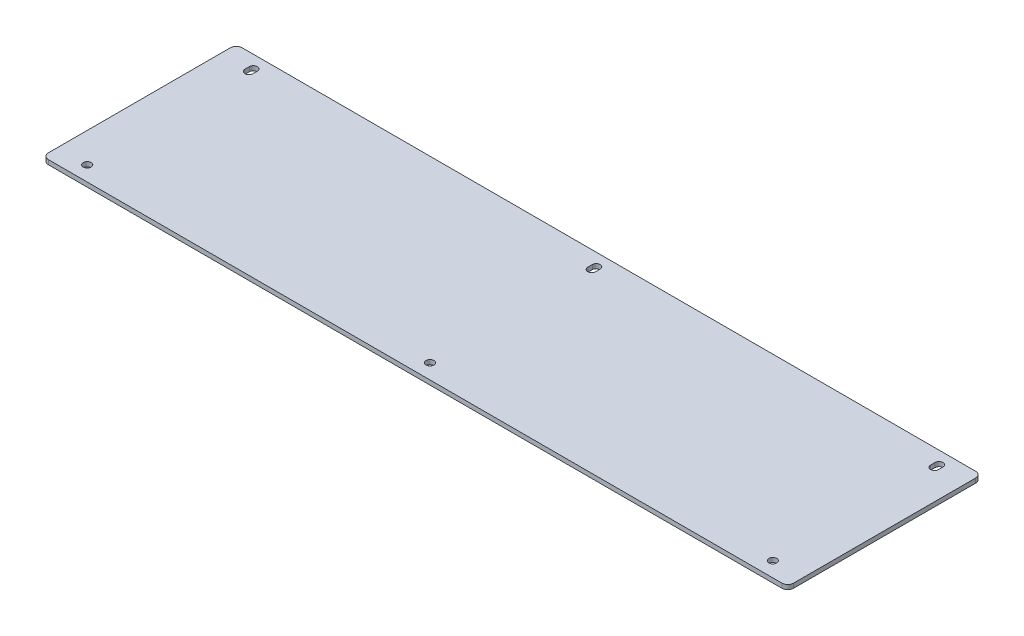
ISO-10303-21;
HEADER;
FILE_DESCRIPTION(('STEP AP214'),'2;1');
FILE_NAME('part.step','',(''),(''),'','','');
FILE_SCHEMA(('AUTOMOTIVE_DESIGN { 1 0 10303 214 1 1 1 1 }'));
ENDSEC;
DATA;
#1=APPLICATION_CONTEXT('core data for automotive mechanical design processes');
#2=APPLICATION_PROTOCOL_DEFINITION('international standard','automotive_design',2000,#1);
#3=PRODUCT_CONTEXT('',#1,'mechanical');
#4=PRODUCT('Part','Part','',(#3));
#5=PRODUCT_RELATED_PRODUCT_CATEGORY('part','',(#4));
#6=PRODUCT_DEFINITION_FORMATION('','',#4);
#7=PRODUCT_DEFINITION_CONTEXT('part definition',#1,'design');
#8=PRODUCT_DEFINITION('design','',#6,#7);
#9=PRODUCT_DEFINITION_SHAPE('','',#8);
#10=(LENGTH_UNIT() NAMED_UNIT(*) SI_UNIT(.MILLI.,.METRE.));
#11=(NAMED_UNIT(*) PLANE_ANGLE_UNIT() SI_UNIT($,.RADIAN.));
#12=(NAMED_UNIT(*) SI_UNIT($,.STERADIAN.) SOLID_ANGLE_UNIT());
#13=UNCERTAINTY_MEASURE_WITH_UNIT(LENGTH_MEASURE(1.E-05),#10,'distance_accuracy_value','');
#14=(GEOMETRIC_REPRESENTATION_CONTEXT(3) GLOBAL_UNCERTAINTY_ASSIGNED_CONTEXT((#13)) GLOBAL_UNIT_ASSIGNED_CONTEXT((#10,
#11,#12)) REPRESENTATION_CONTEXT('',''));
#15=CARTESIAN_POINT('',(0.,0.,0.));
#16=DIRECTION('',(0.,0.,1.));
#17=DIRECTION('',(1.,0.,0.));
#18=AXIS2_PLACEMENT_3D('',#15,#16,#17);
#19=CARTESIAN_POINT('',(250.,3.,65.));
#20=DIRECTION('',(-1.,0.,0.));
#21=DIRECTION('',(0.,0.,1.));
#22=AXIS2_PLACEMENT_3D('',#19,#20,#21);
#23=PLANE('',#22);
#24=DIRECTION('',(0.,0.,-1.));
#25=VECTOR('',#24,1.);
#26=CARTESIAN_POINT('',(250.,0.,65.));
#27=LINE('',#26,#25);
#28=CARTESIAN_POINT('',(250.,0.,61.));
#29=VERTEX_POINT('',#28);
#30=CARTESIAN_POINT('',(250.,0.,-61.));
#31=VERTEX_POINT('',#30);
#32=EDGE_CURVE('E294',#29,#31,#27,.T.);
#33=ORIENTED_EDGE('',*,*,#32,.T.);
#34=DIRECTION('',(0.,-1.,0.));
#35=VECTOR('',#34,1.);
#36=CARTESIAN_POINT('',(250.,3.,-61.));
#37=LINE('',#36,#35);
#38=CARTESIAN_POINT('',(250.,3.,-61.));
#39=VERTEX_POINT('',#38);
#40=EDGE_CURVE('E11',#31,#39,#37,.F.);
#41=ORIENTED_EDGE('',*,*,#40,.T.);
#42=DIRECTION('',(0.,0.,-1.));
#43=VECTOR('',#42,1.);
#44=CARTESIAN_POINT('',(250.,3.,65.));
#45=LINE('',#44,#43);
#46=CARTESIAN_POINT('',(250.,3.,61.));
#47=VERTEX_POINT('',#46);
#48=EDGE_CURVE('E295',#47,#39,#45,.T.);
#49=ORIENTED_EDGE('',*,*,#48,.F.);
#50=DIRECTION('',(0.,-1.,0.));
#51=VECTOR('',#50,1.);
#52=CARTESIAN_POINT('',(250.,3.,61.));
#53=LINE('',#52,#51);
#54=EDGE_CURVE('E43',#47,#29,#53,.T.);
#55=ORIENTED_EDGE('',*,*,#54,.T.);
#56=EDGE_LOOP('',(#33,#41,#49,#55));
#57=FACE_BOUND('',#56,.T.);
#58=ADVANCED_FACE('F35',(#57),#23,.F.);
#59=CARTESIAN_POINT('',(-250.,3.,-65.));
#60=DIRECTION('',(0.,0.,1.));
#61=DIRECTION('',(1.,0.,0.));
#62=AXIS2_PLACEMENT_3D('',#59,#60,#61);
#63=PLANE('',#62);
#64=DIRECTION('',(-1.,0.,0.));
#65=VECTOR('',#64,1.);
#66=CARTESIAN_POINT('',(-250.,0.,-65.));
#67=LINE('',#66,#65);
#68=CARTESIAN_POINT('',(246.,0.,-65.));
#69=VERTEX_POINT('',#68);
#70=CARTESIAN_POINT('',(-246.,0.,-65.));
#71=VERTEX_POINT('',#70);
#72=EDGE_CURVE('E311',#69,#71,#67,.T.);
#73=ORIENTED_EDGE('',*,*,#72,.T.);
#74=DIRECTION('',(0.,-1.,0.));
#75=VECTOR('',#74,1.);
#76=CARTESIAN_POINT('',(-246.,3.,-65.));
#77=LINE('',#76,#75);
#78=CARTESIAN_POINT('',(-246.,3.,-65.));
#79=VERTEX_POINT('',#78);
#80=EDGE_CURVE('E347',#71,#79,#77,.F.);
#81=ORIENTED_EDGE('',*,*,#80,.T.);
#82=DIRECTION('',(-1.,0.,0.));
#83=VECTOR('',#82,1.);
#84=CARTESIAN_POINT('',(-250.,3.,-65.));
#85=LINE('',#84,#83);
#86=CARTESIAN_POINT('',(246.,3.,-65.));
#87=VERTEX_POINT('',#86);
#88=EDGE_CURVE('E298',#87,#79,#85,.T.);
#89=ORIENTED_EDGE('',*,*,#88,.F.);
#90=DIRECTION('',(0.,-1.,0.));
#91=VECTOR('',#90,1.);
#92=CARTESIAN_POINT('',(246.,3.,-65.));
#93=LINE('',#92,#91);
#94=EDGE_CURVE('E344',#87,#69,#93,.T.);
#95=ORIENTED_EDGE('',*,*,#94,.T.);
#96=EDGE_LOOP('',(#73,#81,#89,#95));
#97=FACE_BOUND('',#96,.T.);
#98=ADVANCED_FACE('F365',(#97),#63,.F.);
#99=CARTESIAN_POINT('',(-250.,3.,65.));
#100=DIRECTION('',(1.,0.,0.));
#101=DIRECTION('',(0.,0.,-1.));
#102=AXIS2_PLACEMENT_3D('',#99,#100,#101);
#103=PLANE('',#102);
#104=DIRECTION('',(0.,0.,1.));
#105=VECTOR('',#104,1.);
#106=CARTESIAN_POINT('',(-250.,0.,65.));
#107=LINE('',#106,#105);
#108=CARTESIAN_POINT('',(-250.,0.,-61.));
#109=VERTEX_POINT('',#108);
#110=CARTESIAN_POINT('',(-250.,0.,61.));
#111=VERTEX_POINT('',#110);
#112=EDGE_CURVE('E314',#109,#111,#107,.T.);
#113=ORIENTED_EDGE('',*,*,#112,.T.);
#114=DIRECTION('',(0.,-1.,0.));
#115=VECTOR('',#114,1.);
#116=CARTESIAN_POINT('',(-250.,3.,61.));
#117=LINE('',#116,#115);
#118=CARTESIAN_POINT('',(-250.,3.,61.));
#119=VERTEX_POINT('',#118);
#120=EDGE_CURVE('E334',#111,#119,#117,.F.);
#121=ORIENTED_EDGE('',*,*,#120,.T.);
#122=DIRECTION('',(0.,0.,1.));
#123=VECTOR('',#122,1.);
#124=CARTESIAN_POINT('',(-250.,3.,65.));
#125=LINE('',#124,#123);
#126=CARTESIAN_POINT('',(-250.,3.,-61.));
#127=VERTEX_POINT('',#126);
#128=EDGE_CURVE('E302',#127,#119,#125,.T.);
#129=ORIENTED_EDGE('',*,*,#128,.F.);
#130=DIRECTION('',(0.,-1.,0.));
#131=VECTOR('',#130,1.);
#132=CARTESIAN_POINT('',(-250.,3.,-61.));
#133=LINE('',#132,#131);
#134=EDGE_CURVE('E331',#127,#109,#133,.T.);
#135=ORIENTED_EDGE('',*,*,#134,.T.);
#136=EDGE_LOOP('',(#113,#121,#129,#135));
#137=FACE_BOUND('',#136,.T.);
#138=ADVANCED_FACE('F376',(#137),#103,.F.);
#139=CARTESIAN_POINT('',(-250.,3.,65.));
#140=DIRECTION('',(0.,0.,-1.));
#141=DIRECTION('',(-1.,0.,0.));
#142=AXIS2_PLACEMENT_3D('',#139,#140,#141);
#143=PLANE('',#142);
#144=DIRECTION('',(1.,0.,0.));
#145=VECTOR('',#144,1.);
#146=CARTESIAN_POINT('',(-250.,3.,65.));
#147=LINE('',#146,#145);
#148=CARTESIAN_POINT('',(-246.,3.,65.));
#149=VERTEX_POINT('',#148);
#150=CARTESIAN_POINT('',(246.,3.,65.));
#151=VERTEX_POINT('',#150);
#152=EDGE_CURVE('E305',#149,#151,#147,.T.);
#153=ORIENTED_EDGE('',*,*,#152,.F.);
#154=DIRECTION('',(0.,-1.,0.));
#155=VECTOR('',#154,1.);
#156=CARTESIAN_POINT('',(-246.,3.,65.));
#157=LINE('',#156,#155);
#158=CARTESIAN_POINT('',(-246.,0.,65.));
#159=VERTEX_POINT('',#158);
#160=EDGE_CURVE('E320',#149,#159,#157,.T.);
#161=ORIENTED_EDGE('',*,*,#160,.T.);
#162=DIRECTION('',(1.,0.,0.));
#163=VECTOR('',#162,1.);
#164=CARTESIAN_POINT('',(-250.,0.,65.));
#165=LINE('',#164,#163);
#166=CARTESIAN_POINT('',(246.,0.,65.));
#167=VERTEX_POINT('',#166);
#168=EDGE_CURVE('E299',#159,#167,#165,.T.);
#169=ORIENTED_EDGE('',*,*,#168,.T.);
#170=DIRECTION('',(0.,-1.,0.));
#171=VECTOR('',#170,1.);
#172=CARTESIAN_POINT('',(246.,3.,65.));
#173=LINE('',#172,#171);
#174=EDGE_CURVE('E308',#167,#151,#173,.F.);
#175=ORIENTED_EDGE('',*,*,#174,.T.);
#176=EDGE_LOOP('',(#153,#161,#169,#175));
#177=FACE_BOUND('',#176,.T.);
#178=ADVANCED_FACE('F384',(#177),#143,.F.);
#179=CARTESIAN_POINT('',(0.,3.,0.));
#180=DIRECTION('',(0.,-1.,0.));
#181=DIRECTION('',(0.,0.,-1.));
#182=AXIS2_PLACEMENT_3D('',#179,#180,#181);
#183=PLANE('',#182);
#184=DIRECTION('',(0.,0.,-1.));
#185=VECTOR('',#184,1.);
#186=CARTESIAN_POINT('',(232.65,3.,-53.5000000000001));
#187=LINE('',#186,#185);
#188=CARTESIAN_POINT('',(232.65,3.,-53.5000000000001));
#189=VERTEX_POINT('',#188);
#190=CARTESIAN_POINT('',(232.65,3.,-56.5000000000001));
#191=VERTEX_POINT('',#190);
#192=EDGE_CURVE('E262',#189,#191,#187,.T.);
#193=ORIENTED_EDGE('',*,*,#192,.F.);
#194=CARTESIAN_POINT('',(230.,3.,-53.5000000000001));
#195=DIRECTION('',(0.,1.,0.));
#196=DIRECTION('',(0.,0.,1.));
#197=AXIS2_PLACEMENT_3D('',#194,#195,#196);
#198=CIRCLE('',#197,2.64999999999999);
#199=CARTESIAN_POINT('',(227.35,3.,-53.5000000000001));
#200=VERTEX_POINT('',#199);
#201=EDGE_CURVE('E259',#200,#189,#198,.T.);
#202=ORIENTED_EDGE('',*,*,#201,.F.);
#203=DIRECTION('',(0.,0.,1.));
#204=VECTOR('',#203,1.);
#205=CARTESIAN_POINT('',(227.35,3.,-53.5000000000001));
#206=LINE('',#205,#204);
#207=CARTESIAN_POINT('',(227.35,3.,-56.5000000000001));
#208=VERTEX_POINT('',#207);
#209=EDGE_CURVE('E249',#208,#200,#206,.T.);
#210=ORIENTED_EDGE('',*,*,#209,.F.);
#211=CARTESIAN_POINT('',(230.,3.,-56.5000000000001));
#212=DIRECTION('',(0.,1.,0.));
#213=DIRECTION('',(0.,0.,1.));
#214=AXIS2_PLACEMENT_3D('',#211,#212,#213);
#215=CIRCLE('',#214,2.64999999999999);
#216=EDGE_CURVE('E264',#191,#208,#215,.T.);
#217=ORIENTED_EDGE('',*,*,#216,.F.);
#218=EDGE_LOOP('',(#193,#202,#210,#217));
#219=FACE_BOUND('',#218,.T.);
#220=CARTESIAN_POINT('',(-230.,3.,55.));
#221=DIRECTION('',(0.,1.,0.));
#222=DIRECTION('',(0.,0.,1.));
#223=AXIS2_PLACEMENT_3D('',#220,#221,#222);
#224=CIRCLE('',#223,2.64999999999999);
#225=CARTESIAN_POINT('',(-230.,3.,57.65));
#226=VERTEX_POINT('',#225);
#227=EDGE_CURVE('E210',#226,#226,#224,.T.);
#228=ORIENTED_EDGE('',*,*,#227,.F.);
#229=EDGE_LOOP('',(#228));
#230=FACE_BOUND('',#229,.T.);
#231=DIRECTION('',(0.,0.,-1.));
#232=VECTOR('',#231,1.);
#233=CARTESIAN_POINT('',(-227.35,3.,-53.5));
#234=LINE('',#233,#232);
#235=CARTESIAN_POINT('',(-227.35,3.,-53.5));
#236=VERTEX_POINT('',#235);
#237=CARTESIAN_POINT('',(-227.35,3.,-56.5));
#238=VERTEX_POINT('',#237);
#239=EDGE_CURVE('E50',#236,#238,#234,.T.);
#240=ORIENTED_EDGE('',*,*,#239,.F.);
#241=CARTESIAN_POINT('',(-230.,3.,-53.5));
#242=DIRECTION('',(0.,1.,0.));
#243=DIRECTION('',(0.,0.,1.));
#244=AXIS2_PLACEMENT_3D('',#241,#242,#243);
#245=CIRCLE('',#244,2.64999999999999);
#246=CARTESIAN_POINT('',(-232.65,3.,-53.5));
#247=VERTEX_POINT('',#246);
#248=EDGE_CURVE('E191',#247,#236,#245,.T.);
#249=ORIENTED_EDGE('',*,*,#248,.F.);
#250=DIRECTION('',(0.,0.,1.));
#251=VECTOR('',#250,1.);
#252=CARTESIAN_POINT('',(-232.65,3.,-53.5));
#253=LINE('',#252,#251);
#254=CARTESIAN_POINT('',(-232.65,3.,-56.5));
#255=VERTEX_POINT('',#254);
#256=EDGE_CURVE('E196',#255,#247,#253,.T.);
#257=ORIENTED_EDGE('',*,*,#256,.F.);
#258=CARTESIAN_POINT('',(-230.,3.,-56.5));
#259=DIRECTION('',(0.,1.,0.));
#260=DIRECTION('',(0.,0.,1.));
#261=AXIS2_PLACEMENT_3D('',#258,#259,#260);
#262=CIRCLE('',#261,2.64999999999999);
#263=EDGE_CURVE('E198',#238,#255,#262,.T.);
#264=ORIENTED_EDGE('',*,*,#263,.F.);
#265=EDGE_LOOP('',(#240,#249,#257,#264));
#266=FACE_BOUND('',#265,.T.);
#267=CARTESIAN_POINT('',(230.,3.,55.));
#268=DIRECTION('',(0.,1.,0.));
#269=DIRECTION('',(0.,0.,1.));
#270=AXIS2_PLACEMENT_3D('',#267,#268,#269);
#271=CIRCLE('',#270,2.64999999999999);
#272=CARTESIAN_POINT('',(230.,3.,57.65));
#273=VERTEX_POINT('',#272);
#274=EDGE_CURVE('E282',#273,#273,#271,.T.);
#275=ORIENTED_EDGE('',*,*,#274,.F.);
#276=EDGE_LOOP('',(#275));
#277=FACE_BOUND('',#276,.T.);
#278=DIRECTION('',(0.,0.,-1.));
#279=VECTOR('',#278,1.);
#280=CARTESIAN_POINT('',(2.65,3.,-53.5));
#281=LINE('',#280,#279);
#282=CARTESIAN_POINT('',(2.65,3.,-53.5));
#283=VERTEX_POINT('',#282);
#284=CARTESIAN_POINT('',(2.65,3.,-56.5));
#285=VERTEX_POINT('',#284);
#286=EDGE_CURVE('E58',#283,#285,#281,.T.);
#287=ORIENTED_EDGE('',*,*,#286,.F.);
#288=CARTESIAN_POINT('',(0.,3.,-53.5));
#289=DIRECTION('',(0.,1.,0.));
#290=DIRECTION('',(0.,0.,1.));
#291=AXIS2_PLACEMENT_3D('',#288,#289,#290);
#292=CIRCLE('',#291,2.65);
#293=CARTESIAN_POINT('',(-2.65,3.,-53.5));
#294=VERTEX_POINT('',#293);
#295=EDGE_CURVE('E228',#294,#283,#292,.T.);
#296=ORIENTED_EDGE('',*,*,#295,.F.);
#297=DIRECTION('',(0.,0.,1.));
#298=VECTOR('',#297,1.);
#299=CARTESIAN_POINT('',(-2.65,3.,-53.5));
#300=LINE('',#299,#298);
#301=CARTESIAN_POINT('',(-2.65,3.,-56.5));
#302=VERTEX_POINT('',#301);
#303=EDGE_CURVE('E218',#302,#294,#300,.T.);
#304=ORIENTED_EDGE('',*,*,#303,.F.);
#305=CARTESIAN_POINT('',(0.,3.,-56.5));
#306=DIRECTION('',(0.,1.,0.));
#307=DIRECTION('',(0.,0.,1.));
#308=AXIS2_PLACEMENT_3D('',#305,#306,#307);
#309=CIRCLE('',#308,2.65);
#310=EDGE_CURVE('E232',#285,#302,#309,.T.);
#311=ORIENTED_EDGE('',*,*,#310,.F.);
#312=EDGE_LOOP('',(#287,#296,#304,#311));
#313=FACE_BOUND('',#312,.T.);
#314=CARTESIAN_POINT('',(0.,3.,55.));
#315=DIRECTION('',(0.,1.,0.));
#316=DIRECTION('',(0.,0.,1.));
#317=AXIS2_PLACEMENT_3D('',#314,#315,#316);
#318=CIRCLE('',#317,2.65);
#319=CARTESIAN_POINT('',(0.,3.,57.65));
#320=VERTEX_POINT('',#319);
#321=EDGE_CURVE('E288',#320,#320,#318,.T.);
#322=ORIENTED_EDGE('',*,*,#321,.F.);
#323=EDGE_LOOP('',(#322));
#324=FACE_BOUND('',#323,.T.);
#325=ORIENTED_EDGE('',*,*,#128,.T.);
#326=CARTESIAN_POINT('',(-246.,3.,61.));
#327=DIRECTION('',(0.,-1.,0.));
#328=DIRECTION('',(0.,0.,-1.));
#329=AXIS2_PLACEMENT_3D('',#326,#327,#328);
#330=CIRCLE('',#329,4.);
#331=EDGE_CURVE('E342',#119,#149,#330,.F.);
#332=ORIENTED_EDGE('',*,*,#331,.T.);
#333=ORIENTED_EDGE('',*,*,#152,.T.);
#334=CARTESIAN_POINT('',(246.,3.,61.));
#335=DIRECTION('',(0.,-1.,0.));
#336=DIRECTION('',(0.,0.,-1.));
#337=AXIS2_PLACEMENT_3D('',#334,#335,#336);
#338=CIRCLE('',#337,4.);
#339=EDGE_CURVE('E336',#151,#47,#338,.F.);
#340=ORIENTED_EDGE('',*,*,#339,.T.);
#341=ORIENTED_EDGE('',*,*,#48,.T.);
#342=CARTESIAN_POINT('',(246.,3.,-61.));
#343=DIRECTION('',(0.,-1.,0.));
#344=DIRECTION('',(0.,0.,-1.));
#345=AXIS2_PLACEMENT_3D('',#342,#343,#344);
#346=CIRCLE('',#345,4.);
#347=EDGE_CURVE('E338',#39,#87,#346,.F.);
#348=ORIENTED_EDGE('',*,*,#347,.T.);
#349=ORIENTED_EDGE('',*,*,#88,.T.);
#350=CARTESIAN_POINT('',(-246.,3.,-61.));
#351=DIRECTION('',(0.,-1.,0.));
#352=DIRECTION('',(0.,0.,-1.));
#353=AXIS2_PLACEMENT_3D('',#350,#351,#352);
#354=CIRCLE('',#353,4.);
#355=EDGE_CURVE('E340',#79,#127,#354,.F.);
#356=ORIENTED_EDGE('',*,*,#355,.T.);
#357=EDGE_LOOP('',(#325,#332,#333,#340,#341,#348,#349,#356));
#358=FACE_BOUND('',#357,.T.);
#359=ADVANCED_FACE('F369',(#219,#230,#266,#277,#313,#324,#358),#183,.F.);
#360=CARTESIAN_POINT('',(0.,0.,0.));
#361=DIRECTION('',(0.,-1.,0.));
#362=DIRECTION('',(0.,0.,-1.));
#363=AXIS2_PLACEMENT_3D('',#360,#361,#362);
#364=PLANE('',#363);
#365=CARTESIAN_POINT('',(-230.,0.,-53.5));
#366=DIRECTION('',(0.,1.,0.));
#367=DIRECTION('',(0.,0.,1.));
#368=AXIS2_PLACEMENT_3D('',#365,#366,#367);
#369=CIRCLE('',#368,2.64999999999999);
#370=CARTESIAN_POINT('',(-232.65,0.,-53.5));
#371=VERTEX_POINT('',#370);
#372=CARTESIAN_POINT('',(-227.35,0.,-53.5));
#373=VERTEX_POINT('',#372);
#374=EDGE_CURVE('E184',#371,#373,#369,.T.);
#375=ORIENTED_EDGE('',*,*,#374,.T.);
#376=DIRECTION('',(0.,0.,-1.));
#377=VECTOR('',#376,1.);
#378=CARTESIAN_POINT('',(-227.35,0.,-53.5));
#379=LINE('',#378,#377);
#380=CARTESIAN_POINT('',(-227.35,0.,-56.5));
#381=VERTEX_POINT('',#380);
#382=EDGE_CURVE('E173',#373,#381,#379,.T.);
#383=ORIENTED_EDGE('',*,*,#382,.T.);
#384=CARTESIAN_POINT('',(-230.,0.,-56.5));
#385=DIRECTION('',(0.,1.,0.));
#386=DIRECTION('',(0.,0.,1.));
#387=AXIS2_PLACEMENT_3D('',#384,#385,#386);
#388=CIRCLE('',#387,2.64999999999999);
#389=CARTESIAN_POINT('',(-232.65,0.,-56.5));
#390=VERTEX_POINT('',#389);
#391=EDGE_CURVE('E183',#381,#390,#388,.T.);
#392=ORIENTED_EDGE('',*,*,#391,.T.);
#393=DIRECTION('',(0.,0.,1.));
#394=VECTOR('',#393,1.);
#395=CARTESIAN_POINT('',(-232.65,0.,-53.5));
#396=LINE('',#395,#394);
#397=EDGE_CURVE('E192',#390,#371,#396,.T.);
#398=ORIENTED_EDGE('',*,*,#397,.T.);
#399=EDGE_LOOP('',(#375,#383,#392,#398));
#400=FACE_BOUND('',#399,.T.);
#401=CARTESIAN_POINT('',(0.,0.,-53.5));
#402=DIRECTION('',(0.,1.,0.));
#403=DIRECTION('',(0.,0.,1.));
#404=AXIS2_PLACEMENT_3D('',#401,#402,#403);
#405=CIRCLE('',#404,2.65);
#406=CARTESIAN_POINT('',(-2.65,0.,-53.5));
#407=VERTEX_POINT('',#406);
#408=CARTESIAN_POINT('',(2.65,0.,-53.5));
#409=VERTEX_POINT('',#408);
#410=EDGE_CURVE('E214',#407,#409,#405,.T.);
#411=ORIENTED_EDGE('',*,*,#410,.T.);
#412=DIRECTION('',(0.,0.,-1.));
#413=VECTOR('',#412,1.);
#414=CARTESIAN_POINT('',(2.65,0.,-53.5));
#415=LINE('',#414,#413);
#416=CARTESIAN_POINT('',(2.65,0.,-56.5));
#417=VERTEX_POINT('',#416);
#418=EDGE_CURVE('E217',#409,#417,#415,.T.);
#419=ORIENTED_EDGE('',*,*,#418,.T.);
#420=CARTESIAN_POINT('',(0.,0.,-56.5));
#421=DIRECTION('',(0.,1.,0.));
#422=DIRECTION('',(0.,0.,1.));
#423=AXIS2_PLACEMENT_3D('',#420,#421,#422);
#424=CIRCLE('',#423,2.65);
#425=CARTESIAN_POINT('',(-2.65,0.,-56.5));
#426=VERTEX_POINT('',#425);
#427=EDGE_CURVE('E221',#417,#426,#424,.T.);
#428=ORIENTED_EDGE('',*,*,#427,.T.);
#429=DIRECTION('',(0.,0.,1.));
#430=VECTOR('',#429,1.);
#431=CARTESIAN_POINT('',(-2.65,0.,-53.5));
#432=LINE('',#431,#430);
#433=EDGE_CURVE('E224',#426,#407,#432,.T.);
#434=ORIENTED_EDGE('',*,*,#433,.T.);
#435=EDGE_LOOP('',(#411,#419,#428,#434));
#436=FACE_BOUND('',#435,.T.);
#437=CARTESIAN_POINT('',(230.,0.,-53.5000000000001));
#438=DIRECTION('',(0.,1.,0.));
#439=DIRECTION('',(0.,0.,1.));
#440=AXIS2_PLACEMENT_3D('',#437,#438,#439);
#441=CIRCLE('',#440,2.64999999999999);
#442=CARTESIAN_POINT('',(227.35,0.,-53.5000000000001));
#443=VERTEX_POINT('',#442);
#444=CARTESIAN_POINT('',(232.65,0.,-53.5000000000001));
#445=VERTEX_POINT('',#444);
#446=EDGE_CURVE('E245',#443,#445,#441,.T.);
#447=ORIENTED_EDGE('',*,*,#446,.T.);
#448=DIRECTION('',(0.,0.,-1.));
#449=VECTOR('',#448,1.);
#450=CARTESIAN_POINT('',(232.65,0.,-53.5000000000001));
#451=LINE('',#450,#449);
#452=CARTESIAN_POINT('',(232.65,0.,-56.5000000000001));
#453=VERTEX_POINT('',#452);
#454=EDGE_CURVE('E248',#445,#453,#451,.T.);
#455=ORIENTED_EDGE('',*,*,#454,.T.);
#456=CARTESIAN_POINT('',(230.,0.,-56.5000000000001));
#457=DIRECTION('',(0.,1.,0.));
#458=DIRECTION('',(0.,0.,1.));
#459=AXIS2_PLACEMENT_3D('',#456,#457,#458);
#460=CIRCLE('',#459,2.64999999999999);
#461=CARTESIAN_POINT('',(227.35,0.,-56.5000000000001));
#462=VERTEX_POINT('',#461);
#463=EDGE_CURVE('E252',#453,#462,#460,.T.);
#464=ORIENTED_EDGE('',*,*,#463,.T.);
#465=DIRECTION('',(0.,0.,1.));
#466=VECTOR('',#465,1.);
#467=CARTESIAN_POINT('',(227.35,0.,-53.5000000000001));
#468=LINE('',#467,#466);
#469=EDGE_CURVE('E255',#462,#443,#468,.T.);
#470=ORIENTED_EDGE('',*,*,#469,.T.);
#471=EDGE_LOOP('',(#447,#455,#464,#470));
#472=FACE_BOUND('',#471,.T.);
#473=CARTESIAN_POINT('',(-230.,0.,55.));
#474=DIRECTION('',(0.,1.,0.));
#475=DIRECTION('',(0.,0.,1.));
#476=AXIS2_PLACEMENT_3D('',#473,#474,#475);
#477=CIRCLE('',#476,2.64999999999999);
#478=CARTESIAN_POINT('',(-230.,0.,57.65));
#479=VERTEX_POINT('',#478);
#480=EDGE_CURVE('E279',#479,#479,#477,.T.);
#481=ORIENTED_EDGE('',*,*,#480,.T.);
#482=EDGE_LOOP('',(#481));
#483=FACE_BOUND('',#482,.T.);
#484=CARTESIAN_POINT('',(230.,0.,55.));
#485=DIRECTION('',(0.,1.,0.));
#486=DIRECTION('',(0.,0.,1.));
#487=AXIS2_PLACEMENT_3D('',#484,#485,#486);
#488=CIRCLE('',#487,2.64999999999999);
#489=CARTESIAN_POINT('',(230.,0.,57.65));
#490=VERTEX_POINT('',#489);
#491=EDGE_CURVE('E285',#490,#490,#488,.T.);
#492=ORIENTED_EDGE('',*,*,#491,.T.);
#493=EDGE_LOOP('',(#492));
#494=FACE_BOUND('',#493,.T.);
#495=CARTESIAN_POINT('',(0.,0.,55.));
#496=DIRECTION('',(0.,1.,0.));
#497=DIRECTION('',(0.,0.,1.));
#498=AXIS2_PLACEMENT_3D('',#495,#496,#497);
#499=CIRCLE('',#498,2.65);
#500=CARTESIAN_POINT('',(0.,0.,57.65));
#501=VERTEX_POINT('',#500);
#502=EDGE_CURVE('E291',#501,#501,#499,.T.);
#503=ORIENTED_EDGE('',*,*,#502,.T.);
#504=EDGE_LOOP('',(#503));
#505=FACE_BOUND('',#504,.T.);
#506=ORIENTED_EDGE('',*,*,#168,.F.);
#507=CARTESIAN_POINT('',(-246.,0.,61.));
#508=DIRECTION('',(0.,-1.,0.));
#509=DIRECTION('',(0.,0.,-1.));
#510=AXIS2_PLACEMENT_3D('',#507,#508,#509);
#511=CIRCLE('',#510,4.);
#512=EDGE_CURVE('E329',#159,#111,#511,.T.);
#513=ORIENTED_EDGE('',*,*,#512,.T.);
#514=ORIENTED_EDGE('',*,*,#112,.F.);
#515=CARTESIAN_POINT('',(-246.,0.,-61.));
#516=DIRECTION('',(0.,-1.,0.));
#517=DIRECTION('',(0.,0.,-1.));
#518=AXIS2_PLACEMENT_3D('',#515,#516,#517);
#519=CIRCLE('',#518,4.);
#520=EDGE_CURVE('E327',#109,#71,#519,.T.);
#521=ORIENTED_EDGE('',*,*,#520,.T.);
#522=ORIENTED_EDGE('',*,*,#72,.F.);
#523=CARTESIAN_POINT('',(246.,0.,-61.));
#524=DIRECTION('',(0.,-1.,0.));
#525=DIRECTION('',(0.,0.,-1.));
#526=AXIS2_PLACEMENT_3D('',#523,#524,#525);
#527=CIRCLE('',#526,4.);
#528=EDGE_CURVE('E325',#69,#31,#527,.T.);
#529=ORIENTED_EDGE('',*,*,#528,.T.);
#530=ORIENTED_EDGE('',*,*,#32,.F.);
#531=CARTESIAN_POINT('',(246.,0.,61.));
#532=DIRECTION('',(0.,-1.,0.));
#533=DIRECTION('',(0.,0.,-1.));
#534=AXIS2_PLACEMENT_3D('',#531,#532,#533);
#535=CIRCLE('',#534,4.);
#536=EDGE_CURVE('E323',#29,#167,#535,.T.);
#537=ORIENTED_EDGE('',*,*,#536,.T.);
#538=EDGE_LOOP('',(#506,#513,#514,#521,#522,#529,#530,#537));
#539=FACE_BOUND('',#538,.T.);
#540=ADVANCED_FACE('F194',(#400,#436,#472,#483,#494,#505,#539),#364,.T.);
#541=CARTESIAN_POINT('',(-246.,3.,61.));
#542=DIRECTION('',(0.,-1.,0.));
#543=DIRECTION('',(0.,0.,-1.));
#544=AXIS2_PLACEMENT_3D('',#541,#542,#543);
#545=CYLINDRICAL_SURFACE('',#544,4.);
#546=ORIENTED_EDGE('',*,*,#331,.F.);
#547=ORIENTED_EDGE('',*,*,#120,.F.);
#548=ORIENTED_EDGE('',*,*,#512,.F.);
#549=ORIENTED_EDGE('',*,*,#160,.F.);
#550=EDGE_LOOP('',(#546,#547,#548,#549));
#551=FACE_BOUND('',#550,.T.);
#552=ADVANCED_FACE('F381',(#551),#545,.T.);
#553=CARTESIAN_POINT('',(-246.,3.,-61.));
#554=DIRECTION('',(0.,-1.,0.));
#555=DIRECTION('',(0.,0.,-1.));
#556=AXIS2_PLACEMENT_3D('',#553,#554,#555);
#557=CYLINDRICAL_SURFACE('',#556,4.);
#558=ORIENTED_EDGE('',*,*,#355,.F.);
#559=ORIENTED_EDGE('',*,*,#80,.F.);
#560=ORIENTED_EDGE('',*,*,#520,.F.);
#561=ORIENTED_EDGE('',*,*,#134,.F.);
#562=EDGE_LOOP('',(#558,#559,#560,#561));
#563=FACE_BOUND('',#562,.T.);
#564=ADVANCED_FACE('F373',(#563),#557,.T.);
#565=CARTESIAN_POINT('',(246.,3.,-61.));
#566=DIRECTION('',(0.,-1.,0.));
#567=DIRECTION('',(0.,0.,-1.));
#568=AXIS2_PLACEMENT_3D('',#565,#566,#567);
#569=CYLINDRICAL_SURFACE('',#568,4.);
#570=ORIENTED_EDGE('',*,*,#347,.F.);
#571=ORIENTED_EDGE('',*,*,#40,.F.);
#572=ORIENTED_EDGE('',*,*,#528,.F.);
#573=ORIENTED_EDGE('',*,*,#94,.F.);
#574=EDGE_LOOP('',(#570,#571,#572,#573));
#575=FACE_BOUND('',#574,.T.);
#576=ADVANCED_FACE('F362',(#575),#569,.T.);
#577=CARTESIAN_POINT('',(246.,3.,61.));
#578=DIRECTION('',(0.,-1.,0.));
#579=DIRECTION('',(0.,0.,-1.));
#580=AXIS2_PLACEMENT_3D('',#577,#578,#579);
#581=CYLINDRICAL_SURFACE('',#580,4.);
#582=ORIENTED_EDGE('',*,*,#339,.F.);
#583=ORIENTED_EDGE('',*,*,#174,.F.);
#584=ORIENTED_EDGE('',*,*,#536,.F.);
#585=ORIENTED_EDGE('',*,*,#54,.F.);
#586=EDGE_LOOP('',(#582,#583,#584,#585));
#587=FACE_BOUND('',#586,.T.);
#588=ADVANCED_FACE('F37',(#587),#581,.T.);
#589=CARTESIAN_POINT('',(0.,3.,55.));
#590=DIRECTION('',(0.,1.,0.));
#591=DIRECTION('',(0.,0.,1.));
#592=AXIS2_PLACEMENT_3D('',#589,#590,#591);
#593=CYLINDRICAL_SURFACE('',#592,2.65);
#594=ORIENTED_EDGE('',*,*,#502,.F.);
#595=EDGE_LOOP('',(#594));
#596=FACE_BOUND('',#595,.T.);
#597=ORIENTED_EDGE('',*,*,#321,.T.);
#598=EDGE_LOOP('',(#597));
#599=FACE_BOUND('',#598,.T.);
#600=ADVANCED_FACE('F387',(#596,#599),#593,.F.);
#601=CARTESIAN_POINT('',(230.,3.,55.));
#602=DIRECTION('',(0.,1.,0.));
#603=DIRECTION('',(0.,0.,1.));
#604=AXIS2_PLACEMENT_3D('',#601,#602,#603);
#605=CYLINDRICAL_SURFACE('',#604,2.64999999999999);
#606=ORIENTED_EDGE('',*,*,#491,.F.);
#607=EDGE_LOOP('',(#606));
#608=FACE_BOUND('',#607,.T.);
#609=ORIENTED_EDGE('',*,*,#274,.T.);
#610=EDGE_LOOP('',(#609));
#611=FACE_BOUND('',#610,.T.);
#612=ADVANCED_FACE('F392',(#608,#611),#605,.F.);
#613=CARTESIAN_POINT('',(-230.,3.,55.));
#614=DIRECTION('',(0.,1.,0.));
#615=DIRECTION('',(0.,0.,1.));
#616=AXIS2_PLACEMENT_3D('',#613,#614,#615);
#617=CYLINDRICAL_SURFACE('',#616,2.64999999999999);
#618=ORIENTED_EDGE('',*,*,#480,.F.);
#619=EDGE_LOOP('',(#618));
#620=FACE_BOUND('',#619,.T.);
#621=ORIENTED_EDGE('',*,*,#227,.T.);
#622=EDGE_LOOP('',(#621));
#623=FACE_BOUND('',#622,.T.);
#624=ADVANCED_FACE('F434',(#620,#623),#617,.F.);
#625=CARTESIAN_POINT('',(227.35,0.,-53.5000000000001));
#626=DIRECTION('',(-1.,0.,0.));
#627=DIRECTION('',(0.,0.,1.));
#628=AXIS2_PLACEMENT_3D('',#625,#626,#627);
#629=PLANE('',#628);
#630=ORIENTED_EDGE('',*,*,#209,.T.);
#631=DIRECTION('',(0.,1.,0.));
#632=VECTOR('',#631,1.);
#633=CARTESIAN_POINT('',(227.35,0.,-53.5000000000001));
#634=LINE('',#633,#632);
#635=EDGE_CURVE('E230',#443,#200,#634,.T.);
#636=ORIENTED_EDGE('',*,*,#635,.F.);
#637=ORIENTED_EDGE('',*,*,#469,.F.);
#638=DIRECTION('',(0.,1.,0.));
#639=VECTOR('',#638,1.);
#640=CARTESIAN_POINT('',(227.35,0.,-56.5000000000001));
#641=LINE('',#640,#639);
#642=EDGE_CURVE('E270',#462,#208,#641,.T.);
#643=ORIENTED_EDGE('',*,*,#642,.T.);
#644=EDGE_LOOP('',(#630,#636,#637,#643));
#645=FACE_BOUND('',#644,.T.);
#646=ADVANCED_FACE('F444',(#645),#629,.F.);
#647=CARTESIAN_POINT('',(232.65,0.,-53.5000000000001));
#648=DIRECTION('',(1.,0.,0.));
#649=DIRECTION('',(0.,0.,-1.));
#650=AXIS2_PLACEMENT_3D('',#647,#648,#649);
#651=PLANE('',#650);
#652=ORIENTED_EDGE('',*,*,#192,.T.);
#653=DIRECTION('',(0.,1.,0.));
#654=VECTOR('',#653,1.);
#655=CARTESIAN_POINT('',(232.65,0.,-56.5000000000001));
#656=LINE('',#655,#654);
#657=EDGE_CURVE('E272',#453,#191,#656,.T.);
#658=ORIENTED_EDGE('',*,*,#657,.F.);
#659=ORIENTED_EDGE('',*,*,#454,.F.);
#660=DIRECTION('',(0.,1.,0.));
#661=VECTOR('',#660,1.);
#662=CARTESIAN_POINT('',(232.65,0.,-53.5000000000001));
#663=LINE('',#662,#661);
#664=EDGE_CURVE('E258',#445,#189,#663,.T.);
#665=ORIENTED_EDGE('',*,*,#664,.T.);
#666=EDGE_LOOP('',(#652,#658,#659,#665));
#667=FACE_BOUND('',#666,.T.);
#668=ADVANCED_FACE('F467',(#667),#651,.F.);
#669=CARTESIAN_POINT('',(230.,0.,-53.5000000000001));
#670=DIRECTION('',(0.,1.,0.));
#671=DIRECTION('',(0.,0.,1.));
#672=AXIS2_PLACEMENT_3D('',#669,#670,#671);
#673=CYLINDRICAL_SURFACE('',#672,2.64999999999999);
#674=ORIENTED_EDGE('',*,*,#201,.T.);
#675=ORIENTED_EDGE('',*,*,#664,.F.);
#676=ORIENTED_EDGE('',*,*,#446,.F.);
#677=ORIENTED_EDGE('',*,*,#635,.T.);
#678=EDGE_LOOP('',(#674,#675,#676,#677));
#679=FACE_BOUND('',#678,.T.);
#680=ADVANCED_FACE('F477',(#679),#673,.F.);
#681=CARTESIAN_POINT('',(230.,0.,-56.5000000000001));
#682=DIRECTION('',(0.,1.,0.));
#683=DIRECTION('',(0.,0.,1.));
#684=AXIS2_PLACEMENT_3D('',#681,#682,#683);
#685=CYLINDRICAL_SURFACE('',#684,2.64999999999999);
#686=ORIENTED_EDGE('',*,*,#216,.T.);
#687=ORIENTED_EDGE('',*,*,#642,.F.);
#688=ORIENTED_EDGE('',*,*,#463,.F.);
#689=ORIENTED_EDGE('',*,*,#657,.T.);
#690=EDGE_LOOP('',(#686,#687,#688,#689));
#691=FACE_BOUND('',#690,.T.);
#692=ADVANCED_FACE('F487',(#691),#685,.F.);
#693=CARTESIAN_POINT('',(-2.65,0.,-53.5));
#694=DIRECTION('',(-1.,0.,0.));
#695=DIRECTION('',(0.,0.,1.));
#696=AXIS2_PLACEMENT_3D('',#693,#694,#695);
#697=PLANE('',#696);
#698=ORIENTED_EDGE('',*,*,#303,.T.);
#699=DIRECTION('',(0.,1.,0.));
#700=VECTOR('',#699,1.);
#701=CARTESIAN_POINT('',(-2.65,0.,-53.5));
#702=LINE('',#701,#700);
#703=EDGE_CURVE('E204',#407,#294,#702,.T.);
#704=ORIENTED_EDGE('',*,*,#703,.F.);
#705=ORIENTED_EDGE('',*,*,#433,.F.);
#706=DIRECTION('',(0.,1.,0.));
#707=VECTOR('',#706,1.);
#708=CARTESIAN_POINT('',(-2.65,0.,-56.5));
#709=LINE('',#708,#707);
#710=EDGE_CURVE('E238',#426,#302,#709,.T.);
#711=ORIENTED_EDGE('',*,*,#710,.T.);
#712=EDGE_LOOP('',(#698,#704,#705,#711));
#713=FACE_BOUND('',#712,.T.);
#714=ADVANCED_FACE('F497',(#713),#697,.F.);
#715=CARTESIAN_POINT('',(2.65,0.,-53.5));
#716=DIRECTION('',(1.,0.,0.));
#717=DIRECTION('',(0.,0.,-1.));
#718=AXIS2_PLACEMENT_3D('',#715,#716,#717);
#719=PLANE('',#718);
#720=ORIENTED_EDGE('',*,*,#286,.T.);
#721=DIRECTION('',(0.,1.,0.));
#722=VECTOR('',#721,1.);
#723=CARTESIAN_POINT('',(2.65,0.,-56.5));
#724=LINE('',#723,#722);
#725=EDGE_CURVE('E240',#417,#285,#724,.T.);
#726=ORIENTED_EDGE('',*,*,#725,.F.);
#727=ORIENTED_EDGE('',*,*,#418,.F.);
#728=DIRECTION('',(0.,1.,0.));
#729=VECTOR('',#728,1.);
#730=CARTESIAN_POINT('',(2.65,0.,-53.5));
#731=LINE('',#730,#729);
#732=EDGE_CURVE('E227',#409,#283,#731,.T.);
#733=ORIENTED_EDGE('',*,*,#732,.T.);
#734=EDGE_LOOP('',(#720,#726,#727,#733));
#735=FACE_BOUND('',#734,.T.);
#736=ADVANCED_FACE('F507',(#735),#719,.F.);
#737=CARTESIAN_POINT('',(0.,0.,-53.5));
#738=DIRECTION('',(0.,1.,0.));
#739=DIRECTION('',(0.,0.,1.));
#740=AXIS2_PLACEMENT_3D('',#737,#738,#739);
#741=CYLINDRICAL_SURFACE('',#740,2.65);
#742=ORIENTED_EDGE('',*,*,#295,.T.);
#743=ORIENTED_EDGE('',*,*,#732,.F.);
#744=ORIENTED_EDGE('',*,*,#410,.F.);
#745=ORIENTED_EDGE('',*,*,#703,.T.);
#746=EDGE_LOOP('',(#742,#743,#744,#745));
#747=FACE_BOUND('',#746,.T.);
#748=ADVANCED_FACE('F517',(#747),#741,.F.);
#749=CARTESIAN_POINT('',(0.,0.,-56.5));
#750=DIRECTION('',(0.,1.,0.));
#751=DIRECTION('',(0.,0.,1.));
#752=AXIS2_PLACEMENT_3D('',#749,#750,#751);
#753=CYLINDRICAL_SURFACE('',#752,2.65);
#754=ORIENTED_EDGE('',*,*,#310,.T.);
#755=ORIENTED_EDGE('',*,*,#710,.F.);
#756=ORIENTED_EDGE('',*,*,#427,.F.);
#757=ORIENTED_EDGE('',*,*,#725,.T.);
#758=EDGE_LOOP('',(#754,#755,#756,#757));
#759=FACE_BOUND('',#758,.T.);
#760=ADVANCED_FACE('F527',(#759),#753,.F.);
#761=CARTESIAN_POINT('',(-232.65,0.,-53.5));
#762=DIRECTION('',(-1.,0.,0.));
#763=DIRECTION('',(0.,0.,1.));
#764=AXIS2_PLACEMENT_3D('',#761,#762,#763);
#765=PLANE('',#764);
#766=ORIENTED_EDGE('',*,*,#256,.T.);
#767=DIRECTION('',(0.,1.,0.));
#768=VECTOR('',#767,1.);
#769=CARTESIAN_POINT('',(-232.65,0.,-53.5));
#770=LINE('',#769,#768);
#771=EDGE_CURVE('E208',#371,#247,#770,.T.);
#772=ORIENTED_EDGE('',*,*,#771,.F.);
#773=ORIENTED_EDGE('',*,*,#397,.F.);
#774=DIRECTION('',(0.,1.,0.));
#775=VECTOR('',#774,1.);
#776=CARTESIAN_POINT('',(-232.65,0.,-56.5));
#777=LINE('',#776,#775);
#778=EDGE_CURVE('E211',#390,#255,#777,.T.);
#779=ORIENTED_EDGE('',*,*,#778,.T.);
#780=EDGE_LOOP('',(#766,#772,#773,#779));
#781=FACE_BOUND('',#780,.T.);
#782=ADVANCED_FACE('F537',(#781),#765,.F.);
#783=CARTESIAN_POINT('',(-227.35,0.,-53.5));
#784=DIRECTION('',(1.,0.,0.));
#785=DIRECTION('',(0.,0.,-1.));
#786=AXIS2_PLACEMENT_3D('',#783,#784,#785);
#787=PLANE('',#786);
#788=ORIENTED_EDGE('',*,*,#239,.T.);
#789=DIRECTION('',(0.,1.,0.));
#790=VECTOR('',#789,1.);
#791=CARTESIAN_POINT('',(-227.35,0.,-56.5));
#792=LINE('',#791,#790);
#793=EDGE_CURVE('E178',#381,#238,#792,.T.);
#794=ORIENTED_EDGE('',*,*,#793,.F.);
#795=ORIENTED_EDGE('',*,*,#382,.F.);
#796=DIRECTION('',(0.,1.,0.));
#797=VECTOR('',#796,1.);
#798=CARTESIAN_POINT('',(-227.35,0.,-53.5));
#799=LINE('',#798,#797);
#800=EDGE_CURVE('E176',#373,#236,#799,.T.);
#801=ORIENTED_EDGE('',*,*,#800,.T.);
#802=EDGE_LOOP('',(#788,#794,#795,#801));
#803=FACE_BOUND('',#802,.T.);
#804=ADVANCED_FACE('F175',(#803),#787,.F.);
#805=CARTESIAN_POINT('',(-230.,0.,-53.5));
#806=DIRECTION('',(0.,1.,0.));
#807=DIRECTION('',(0.,0.,1.));
#808=AXIS2_PLACEMENT_3D('',#805,#806,#807);
#809=CYLINDRICAL_SURFACE('',#808,2.64999999999999);
#810=ORIENTED_EDGE('',*,*,#248,.T.);
#811=ORIENTED_EDGE('',*,*,#800,.F.);
#812=ORIENTED_EDGE('',*,*,#374,.F.);
#813=ORIENTED_EDGE('',*,*,#771,.T.);
#814=EDGE_LOOP('',(#810,#811,#812,#813));
#815=FACE_BOUND('',#814,.T.);
#816=ADVANCED_FACE('F188',(#815),#809,.F.);
#817=CARTESIAN_POINT('',(-230.,0.,-56.5));
#818=DIRECTION('',(0.,1.,0.));
#819=DIRECTION('',(0.,0.,1.));
#820=AXIS2_PLACEMENT_3D('',#817,#818,#819);
#821=CYLINDRICAL_SURFACE('',#820,2.64999999999999);
#822=ORIENTED_EDGE('',*,*,#263,.T.);
#823=ORIENTED_EDGE('',*,*,#778,.F.);
#824=ORIENTED_EDGE('',*,*,#391,.F.);
#825=ORIENTED_EDGE('',*,*,#793,.T.);
#826=EDGE_LOOP('',(#822,#823,#824,#825));
#827=FACE_BOUND('',#826,.T.);
#828=ADVANCED_FACE('F564',(#827),#821,.F.);
#829=CLOSED_SHELL('',(#58,#98,#138,#178,#359,#540,#552,#564,#576,#588,#600,#612,#624,#646,#668,
#680,#692,#714,#736,#748,#760,#782,#804,#816,#828));
#830=MANIFOLD_SOLID_BREP('B2',#829);
#831=ADVANCED_BREP_SHAPE_REPRESENTATION('',(#18,#830),#14);
#832=SHAPE_DEFINITION_REPRESENTATION(#9,#831);
ENDSEC;
END-ISO-10303-21;
